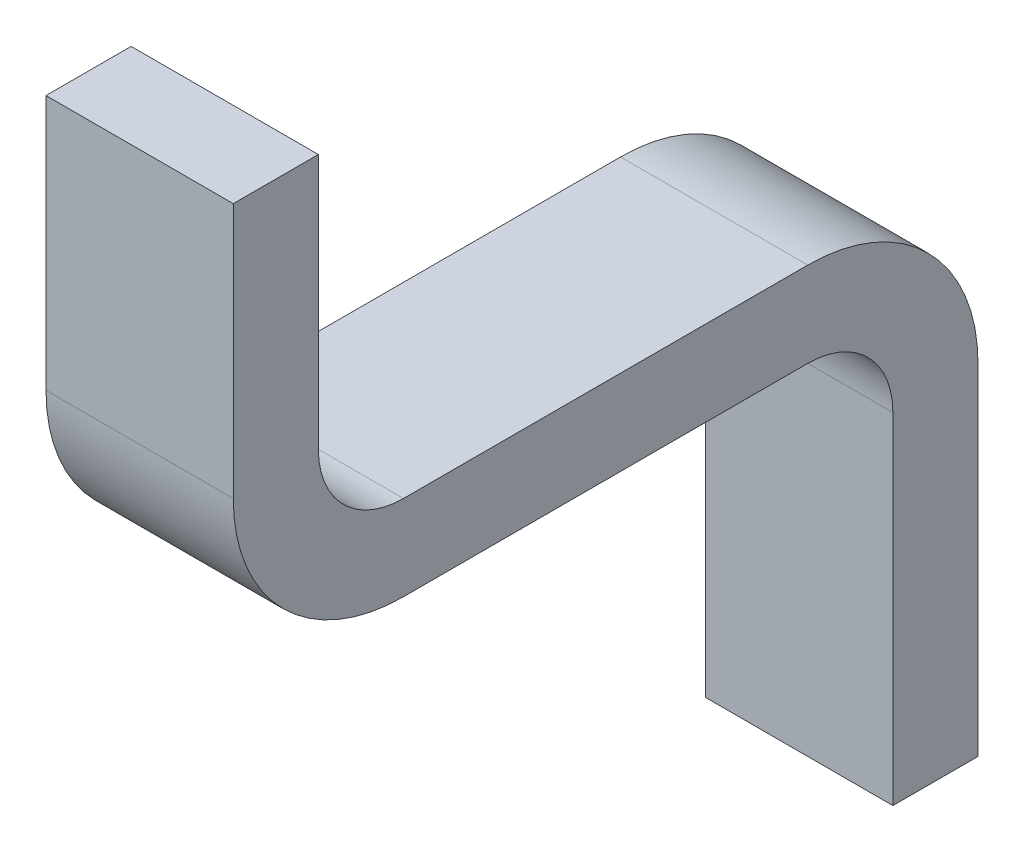
ISO-10303-21;
HEADER;
FILE_DESCRIPTION(('STEP AP214'),'2;1');
FILE_NAME('part.step','',(''),(''),'','','');
FILE_SCHEMA(('AUTOMOTIVE_DESIGN { 1 0 10303 214 1 1 1 1 }'));
ENDSEC;
DATA;
#1=APPLICATION_CONTEXT('core data for automotive mechanical design processes');
#2=APPLICATION_PROTOCOL_DEFINITION('international standard','automotive_design',2000,#1);
#3=PRODUCT_CONTEXT('',#1,'mechanical');
#4=PRODUCT('Part','Part','',(#3));
#5=PRODUCT_RELATED_PRODUCT_CATEGORY('part','',(#4));
#6=PRODUCT_DEFINITION_FORMATION('','',#4);
#7=PRODUCT_DEFINITION_CONTEXT('part definition',#1,'design');
#8=PRODUCT_DEFINITION('design','',#6,#7);
#9=PRODUCT_DEFINITION_SHAPE('','',#8);
#10=(LENGTH_UNIT() NAMED_UNIT(*) SI_UNIT(.MILLI.,.METRE.));
#11=(NAMED_UNIT(*) PLANE_ANGLE_UNIT() SI_UNIT($,.RADIAN.));
#12=(NAMED_UNIT(*) SI_UNIT($,.STERADIAN.) SOLID_ANGLE_UNIT());
#13=UNCERTAINTY_MEASURE_WITH_UNIT(LENGTH_MEASURE(1.E-05),#10,'distance_accuracy_value','');
#14=(GEOMETRIC_REPRESENTATION_CONTEXT(3) GLOBAL_UNCERTAINTY_ASSIGNED_CONTEXT((#13)) GLOBAL_UNIT_ASSIGNED_CONTEXT((#10,
#11,#12)) REPRESENTATION_CONTEXT('',''));
#15=CARTESIAN_POINT('',(0.,0.,0.));
#16=DIRECTION('',(0.,0.,1.));
#17=DIRECTION('',(1.,0.,0.));
#18=AXIS2_PLACEMENT_3D('',#15,#16,#17);
#19=CARTESIAN_POINT('',(-0.86,-4.,0.675));
#20=DIRECTION('',(1.,0.,0.));
#21=DIRECTION('',(0.,1.,0.));
#22=AXIS2_PLACEMENT_3D('',#19,#20,#21);
#23=PLANE('',#22);
#24=CARTESIAN_POINT('',(-0.860000000000001,-3.8,0.675));
#25=DIRECTION('',(-1.,0.,0.));
#26=DIRECTION('',(0.,-1.,0.));
#27=AXIS2_PLACEMENT_3D('',#24,#25,#26);
#28=CIRCLE('',#27,0.2);
#29=CARTESIAN_POINT('',(-0.860000000000001,-3.8,0.875));
#30=VERTEX_POINT('',#29);
#31=CARTESIAN_POINT('',(-0.86,-4.,0.675));
#32=VERTEX_POINT('',#31);
#33=EDGE_CURVE('E150',#30,#32,#28,.F.);
#34=ORIENTED_EDGE('',*,*,#33,.F.);
#35=DIRECTION('',(0.,1.,0.));
#36=VECTOR('',#35,1.);
#37=CARTESIAN_POINT('',(-0.86,-3.50000000000001,0.875));
#38=LINE('',#37,#36);
#39=CARTESIAN_POINT('',(-0.86,-3.50000000000001,0.875));
#40=VERTEX_POINT('',#39);
#41=EDGE_CURVE('E147',#30,#40,#38,.T.);
#42=ORIENTED_EDGE('',*,*,#41,.T.);
#43=DIRECTION('',(0.,0.,1.));
#44=VECTOR('',#43,1.);
#45=CARTESIAN_POINT('',(-0.86,-3.50000000000001,0.775));
#46=LINE('',#45,#44);
#47=CARTESIAN_POINT('',(-0.86,-3.50000000000001,0.775));
#48=VERTEX_POINT('',#47);
#49=EDGE_CURVE('E141',#48,#40,#46,.T.);
#50=ORIENTED_EDGE('',*,*,#49,.F.);
#51=DIRECTION('',(0.,1.,0.));
#52=VECTOR('',#51,1.);
#53=CARTESIAN_POINT('',(-0.86,-3.50000000000001,0.775));
#54=LINE('',#53,#52);
#55=CARTESIAN_POINT('',(-0.860000000000001,-3.8,0.775));
#56=VERTEX_POINT('',#55);
#57=EDGE_CURVE('E115',#48,#56,#54,.F.);
#58=ORIENTED_EDGE('',*,*,#57,.T.);
#59=CARTESIAN_POINT('',(-0.860000000000001,-3.8,0.675));
#60=DIRECTION('',(-1.,0.,0.));
#61=DIRECTION('',(0.,-1.,0.));
#62=AXIS2_PLACEMENT_3D('',#59,#60,#61);
#63=CIRCLE('',#62,0.1);
#64=CARTESIAN_POINT('',(-0.860000000000001,-3.90000000000001,0.675));
#65=VERTEX_POINT('',#64);
#66=EDGE_CURVE('E215',#56,#65,#63,.F.);
#67=ORIENTED_EDGE('',*,*,#66,.T.);
#68=DIRECTION('',(0.,0.,1.));
#69=VECTOR('',#68,1.);
#70=CARTESIAN_POINT('',(-0.860000000000001,-3.90000000000001,0.675));
#71=LINE('',#70,#69);
#72=CARTESIAN_POINT('',(-0.860000000000001,-3.90000000000001,0.2));
#73=VERTEX_POINT('',#72);
#74=EDGE_CURVE('E181',#65,#73,#71,.F.);
#75=ORIENTED_EDGE('',*,*,#74,.T.);
#76=CARTESIAN_POINT('',(-0.86,-4.1,0.2));
#77=DIRECTION('',(1.,0.,0.));
#78=DIRECTION('',(0.,1.,0.));
#79=AXIS2_PLACEMENT_3D('',#76,#77,#78);
#80=CIRCLE('',#79,0.2);
#81=CARTESIAN_POINT('',(-0.86,-4.1,0.));
#82=VERTEX_POINT('',#81);
#83=EDGE_CURVE('E20',#82,#73,#80,.T.);
#84=ORIENTED_EDGE('',*,*,#83,.F.);
#85=DIRECTION('',(0.,1.,0.));
#86=VECTOR('',#85,1.);
#87=CARTESIAN_POINT('',(-0.86,-4.1,0.));
#88=LINE('',#87,#86);
#89=CARTESIAN_POINT('',(-0.86,-4.5,0.));
#90=VERTEX_POINT('',#89);
#91=EDGE_CURVE('E91',#82,#90,#88,.F.);
#92=ORIENTED_EDGE('',*,*,#91,.T.);
#93=DIRECTION('',(0.,0.,1.));
#94=VECTOR('',#93,1.);
#95=CARTESIAN_POINT('',(-0.86,-4.5,0.));
#96=LINE('',#95,#94);
#97=CARTESIAN_POINT('',(-0.86,-4.5,0.1));
#98=VERTEX_POINT('',#97);
#99=EDGE_CURVE('E163',#90,#98,#96,.T.);
#100=ORIENTED_EDGE('',*,*,#99,.T.);
#101=DIRECTION('',(0.,1.,0.));
#102=VECTOR('',#101,1.);
#103=CARTESIAN_POINT('',(-0.86,-4.1,0.1));
#104=LINE('',#103,#102);
#105=CARTESIAN_POINT('',(-0.86,-4.1,0.1));
#106=VERTEX_POINT('',#105);
#107=EDGE_CURVE('E159',#98,#106,#104,.T.);
#108=ORIENTED_EDGE('',*,*,#107,.T.);
#109=CARTESIAN_POINT('',(-0.86,-4.1,0.2));
#110=DIRECTION('',(1.,0.,0.));
#111=DIRECTION('',(0.,1.,0.));
#112=AXIS2_PLACEMENT_3D('',#109,#110,#111);
#113=CIRCLE('',#112,0.1);
#114=CARTESIAN_POINT('',(-0.86,-4.,0.2));
#115=VERTEX_POINT('',#114);
#116=EDGE_CURVE('E155',#106,#115,#113,.T.);
#117=ORIENTED_EDGE('',*,*,#116,.T.);
#118=DIRECTION('',(0.,0.,1.));
#119=VECTOR('',#118,1.);
#120=CARTESIAN_POINT('',(-0.86,-4.,0.675));
#121=LINE('',#120,#119);
#122=EDGE_CURVE('E154',#115,#32,#121,.T.);
#123=ORIENTED_EDGE('',*,*,#122,.T.);
#124=EDGE_LOOP('',(#34,#42,#50,#58,#67,#75,#84,#92,#100,#108,#117,#123));
#125=FACE_BOUND('',#124,.T.);
#126=ADVANCED_FACE('F17',(#125),#23,.F.);
#127=CARTESIAN_POINT('',(-0.86,-4.1,0.2));
#128=DIRECTION('',(1.,0.,0.));
#129=DIRECTION('',(0.,1.,0.));
#130=AXIS2_PLACEMENT_3D('',#127,#128,#129);
#131=CYLINDRICAL_SURFACE('',#130,0.2);
#132=CARTESIAN_POINT('',(-0.64,-4.1,0.2));
#133=DIRECTION('',(1.,0.,0.));
#134=DIRECTION('',(0.,1.,0.));
#135=AXIS2_PLACEMENT_3D('',#132,#133,#134);
#136=CIRCLE('',#135,0.2);
#137=CARTESIAN_POINT('',(-0.640000000000001,-3.90000000000001,0.2));
#138=VERTEX_POINT('',#137);
#139=CARTESIAN_POINT('',(-0.64,-4.1,0.));
#140=VERTEX_POINT('',#139);
#141=EDGE_CURVE('E183',#138,#140,#136,.F.);
#142=ORIENTED_EDGE('',*,*,#141,.T.);
#143=DIRECTION('',(1.,0.,0.));
#144=VECTOR('',#143,1.);
#145=CARTESIAN_POINT('',(-0.86,-4.1,0.));
#146=LINE('',#145,#144);
#147=EDGE_CURVE('E178',#140,#82,#146,.F.);
#148=ORIENTED_EDGE('',*,*,#147,.T.);
#149=ORIENTED_EDGE('',*,*,#83,.T.);
#150=DIRECTION('',(1.,0.,0.));
#151=VECTOR('',#150,1.);
#152=CARTESIAN_POINT('',(-0.860000000000001,-3.90000000000001,0.2));
#153=LINE('',#152,#151);
#154=EDGE_CURVE('E217',#73,#138,#153,.T.);
#155=ORIENTED_EDGE('',*,*,#154,.T.);
#156=EDGE_LOOP('',(#142,#148,#149,#155));
#157=FACE_BOUND('',#156,.T.);
#158=ADVANCED_FACE('F254',(#157),#131,.T.);
#159=CARTESIAN_POINT('',(-0.86,-4.1,0.));
#160=DIRECTION('',(0.,0.,1.));
#161=DIRECTION('',(1.,0.,0.));
#162=AXIS2_PLACEMENT_3D('',#159,#160,#161);
#163=PLANE('',#162);
#164=ORIENTED_EDGE('',*,*,#147,.F.);
#165=DIRECTION('',(0.,-1.,0.));
#166=VECTOR('',#165,1.);
#167=CARTESIAN_POINT('',(-0.640000000000001,-3.90000000000001,0.));
#168=LINE('',#167,#166);
#169=CARTESIAN_POINT('',(-0.64,-4.5,0.));
#170=VERTEX_POINT('',#169);
#171=EDGE_CURVE('E170',#140,#170,#168,.T.);
#172=ORIENTED_EDGE('',*,*,#171,.T.);
#173=DIRECTION('',(-1.,0.,0.));
#174=VECTOR('',#173,1.);
#175=CARTESIAN_POINT('',(-0.86,-4.5,0.));
#176=LINE('',#175,#174);
#177=EDGE_CURVE('E173',#170,#90,#176,.T.);
#178=ORIENTED_EDGE('',*,*,#177,.T.);
#179=ORIENTED_EDGE('',*,*,#91,.F.);
#180=EDGE_LOOP('',(#164,#172,#178,#179));
#181=FACE_BOUND('',#180,.T.);
#182=ADVANCED_FACE('F257',(#181),#163,.F.);
#183=CARTESIAN_POINT('',(-0.86,-4.5,0.));
#184=DIRECTION('',(0.,1.,0.));
#185=DIRECTION('',(-1.,0.,0.));
#186=AXIS2_PLACEMENT_3D('',#183,#184,#185);
#187=PLANE('',#186);
#188=DIRECTION('',(-1.,0.,0.));
#189=VECTOR('',#188,1.);
#190=CARTESIAN_POINT('',(-0.64,-4.5,0.1));
#191=LINE('',#190,#189);
#192=CARTESIAN_POINT('',(-0.64,-4.5,0.1));
#193=VERTEX_POINT('',#192);
#194=EDGE_CURVE('E160',#193,#98,#191,.T.);
#195=ORIENTED_EDGE('',*,*,#194,.T.);
#196=ORIENTED_EDGE('',*,*,#99,.F.);
#197=ORIENTED_EDGE('',*,*,#177,.F.);
#198=DIRECTION('',(0.,0.,1.));
#199=VECTOR('',#198,1.);
#200=CARTESIAN_POINT('',(-0.64,-4.5,0.675));
#201=LINE('',#200,#199);
#202=EDGE_CURVE('E166',#170,#193,#201,.T.);
#203=ORIENTED_EDGE('',*,*,#202,.T.);
#204=EDGE_LOOP('',(#195,#196,#197,#203));
#205=FACE_BOUND('',#204,.T.);
#206=ADVANCED_FACE('F259',(#205),#187,.F.);
#207=CARTESIAN_POINT('',(-0.64,-4.1,0.1));
#208=DIRECTION('',(0.,0.,-1.));
#209=DIRECTION('',(-1.,0.,0.));
#210=AXIS2_PLACEMENT_3D('',#207,#208,#209);
#211=PLANE('',#210);
#212=DIRECTION('',(1.,0.,0.));
#213=VECTOR('',#212,1.);
#214=CARTESIAN_POINT('',(-0.64,-4.1,0.1));
#215=LINE('',#214,#213);
#216=CARTESIAN_POINT('',(-0.64,-4.1,0.1));
#217=VERTEX_POINT('',#216);
#218=EDGE_CURVE('E156',#217,#106,#215,.F.);
#219=ORIENTED_EDGE('',*,*,#218,.T.);
#220=ORIENTED_EDGE('',*,*,#107,.F.);
#221=ORIENTED_EDGE('',*,*,#194,.F.);
#222=DIRECTION('',(0.,-1.,0.));
#223=VECTOR('',#222,1.);
#224=CARTESIAN_POINT('',(-0.640000000000001,-3.90000000000001,0.1));
#225=LINE('',#224,#223);
#226=EDGE_CURVE('E169',#193,#217,#225,.F.);
#227=ORIENTED_EDGE('',*,*,#226,.T.);
#228=EDGE_LOOP('',(#219,#220,#221,#227));
#229=FACE_BOUND('',#228,.T.);
#230=ADVANCED_FACE('F234',(#229),#211,.F.);
#231=CARTESIAN_POINT('',(-0.64,-4.1,0.2));
#232=DIRECTION('',(1.,0.,0.));
#233=DIRECTION('',(0.,1.,0.));
#234=AXIS2_PLACEMENT_3D('',#231,#232,#233);
#235=CYLINDRICAL_SURFACE('',#234,0.1);
#236=DIRECTION('',(-1.,0.,0.));
#237=VECTOR('',#236,1.);
#238=CARTESIAN_POINT('',(-0.64,-4.,0.2));
#239=LINE('',#238,#237);
#240=CARTESIAN_POINT('',(-0.64,-4.,0.2));
#241=VERTEX_POINT('',#240);
#242=EDGE_CURVE('E151',#241,#115,#239,.T.);
#243=ORIENTED_EDGE('',*,*,#242,.T.);
#244=ORIENTED_EDGE('',*,*,#116,.F.);
#245=ORIENTED_EDGE('',*,*,#218,.F.);
#246=CARTESIAN_POINT('',(-0.64,-4.1,0.2));
#247=DIRECTION('',(1.,0.,0.));
#248=DIRECTION('',(0.,1.,0.));
#249=AXIS2_PLACEMENT_3D('',#246,#247,#248);
#250=CIRCLE('',#249,0.1);
#251=EDGE_CURVE('E210',#217,#241,#250,.T.);
#252=ORIENTED_EDGE('',*,*,#251,.T.);
#253=EDGE_LOOP('',(#243,#244,#245,#252));
#254=FACE_BOUND('',#253,.T.);
#255=ADVANCED_FACE('F227',(#254),#235,.F.);
#256=CARTESIAN_POINT('',(-0.64,-4.,0.675));
#257=DIRECTION('',(0.,1.,0.));
#258=DIRECTION('',(-1.,0.,0.));
#259=AXIS2_PLACEMENT_3D('',#256,#257,#258);
#260=PLANE('',#259);
#261=DIRECTION('',(-1.,0.,0.));
#262=VECTOR('',#261,1.);
#263=CARTESIAN_POINT('',(-0.64,-4.,0.675));
#264=LINE('',#263,#262);
#265=CARTESIAN_POINT('',(-0.64,-4.,0.675));
#266=VERTEX_POINT('',#265);
#267=EDGE_CURVE('E148',#32,#266,#264,.F.);
#268=ORIENTED_EDGE('',*,*,#267,.F.);
#269=ORIENTED_EDGE('',*,*,#122,.F.);
#270=ORIENTED_EDGE('',*,*,#242,.F.);
#271=DIRECTION('',(0.,0.,1.));
#272=VECTOR('',#271,1.);
#273=CARTESIAN_POINT('',(-0.64,-4.,0.675));
#274=LINE('',#273,#272);
#275=EDGE_CURVE('E209',#241,#266,#274,.T.);
#276=ORIENTED_EDGE('',*,*,#275,.T.);
#277=EDGE_LOOP('',(#268,#269,#270,#276));
#278=FACE_BOUND('',#277,.T.);
#279=ADVANCED_FACE('F224',(#278),#260,.F.);
#280=CARTESIAN_POINT('',(-0.640000000000001,-3.8,0.675));
#281=DIRECTION('',(-1.,0.,0.));
#282=DIRECTION('',(0.,-1.,0.));
#283=AXIS2_PLACEMENT_3D('',#280,#281,#282);
#284=CYLINDRICAL_SURFACE('',#283,0.2);
#285=ORIENTED_EDGE('',*,*,#33,.T.);
#286=ORIENTED_EDGE('',*,*,#267,.T.);
#287=CARTESIAN_POINT('',(-0.640000000000001,-3.8,0.675));
#288=DIRECTION('',(-1.,0.,0.));
#289=DIRECTION('',(0.,-1.,0.));
#290=AXIS2_PLACEMENT_3D('',#287,#288,#289);
#291=CIRCLE('',#290,0.2);
#292=CARTESIAN_POINT('',(-0.640000000000001,-3.8,0.875));
#293=VERTEX_POINT('',#292);
#294=EDGE_CURVE('E133',#266,#293,#291,.T.);
#295=ORIENTED_EDGE('',*,*,#294,.T.);
#296=DIRECTION('',(-1.,0.,0.));
#297=VECTOR('',#296,1.);
#298=CARTESIAN_POINT('',(-0.640000000000001,-3.8,0.875));
#299=LINE('',#298,#297);
#300=EDGE_CURVE('E144',#293,#30,#299,.T.);
#301=ORIENTED_EDGE('',*,*,#300,.T.);
#302=EDGE_LOOP('',(#285,#286,#295,#301));
#303=FACE_BOUND('',#302,.T.);
#304=ADVANCED_FACE('F285',(#303),#284,.T.);
#305=CARTESIAN_POINT('',(-0.64,-3.50000000000001,0.875));
#306=DIRECTION('',(0.,0.,-1.));
#307=DIRECTION('',(-1.,0.,0.));
#308=AXIS2_PLACEMENT_3D('',#305,#306,#307);
#309=PLANE('',#308);
#310=DIRECTION('',(-1.,0.,0.));
#311=VECTOR('',#310,1.);
#312=CARTESIAN_POINT('',(-0.86,-3.50000000000001,0.875));
#313=LINE('',#312,#311);
#314=CARTESIAN_POINT('',(-0.64,-3.50000000000001,0.875));
#315=VERTEX_POINT('',#314);
#316=EDGE_CURVE('E118',#40,#315,#313,.F.);
#317=ORIENTED_EDGE('',*,*,#316,.F.);
#318=ORIENTED_EDGE('',*,*,#41,.F.);
#319=ORIENTED_EDGE('',*,*,#300,.F.);
#320=DIRECTION('',(0.,-1.,0.));
#321=VECTOR('',#320,1.);
#322=CARTESIAN_POINT('',(-0.640000000000001,-3.90000000000001,0.875));
#323=LINE('',#322,#321);
#324=EDGE_CURVE('E131',#293,#315,#323,.F.);
#325=ORIENTED_EDGE('',*,*,#324,.T.);
#326=EDGE_LOOP('',(#317,#318,#319,#325));
#327=FACE_BOUND('',#326,.T.);
#328=ADVANCED_FACE('F282',(#327),#309,.F.);
#329=CARTESIAN_POINT('',(-0.86,-3.50000000000001,0.775));
#330=DIRECTION('',(0.,1.,0.));
#331=DIRECTION('',(-1.,0.,0.));
#332=AXIS2_PLACEMENT_3D('',#329,#330,#331);
#333=PLANE('',#332);
#334=ORIENTED_EDGE('',*,*,#49,.T.);
#335=ORIENTED_EDGE('',*,*,#316,.T.);
#336=DIRECTION('',(0.,0.,1.));
#337=VECTOR('',#336,1.);
#338=CARTESIAN_POINT('',(-0.64,-3.50000000000001,0.675));
#339=LINE('',#338,#337);
#340=CARTESIAN_POINT('',(-0.64,-3.50000000000001,0.775));
#341=VERTEX_POINT('',#340);
#342=EDGE_CURVE('E125',#315,#341,#339,.F.);
#343=ORIENTED_EDGE('',*,*,#342,.T.);
#344=DIRECTION('',(1.,0.,0.));
#345=VECTOR('',#344,1.);
#346=CARTESIAN_POINT('',(-0.86,-3.50000000000001,0.775));
#347=LINE('',#346,#345);
#348=EDGE_CURVE('E110',#341,#48,#347,.F.);
#349=ORIENTED_EDGE('',*,*,#348,.T.);
#350=EDGE_LOOP('',(#334,#335,#343,#349));
#351=FACE_BOUND('',#350,.T.);
#352=ADVANCED_FACE('F129',(#351),#333,.T.);
#353=CARTESIAN_POINT('',(-0.86,-3.50000000000001,0.775));
#354=DIRECTION('',(0.,0.,1.));
#355=DIRECTION('',(1.,0.,0.));
#356=AXIS2_PLACEMENT_3D('',#353,#354,#355);
#357=PLANE('',#356);
#358=ORIENTED_EDGE('',*,*,#348,.F.);
#359=DIRECTION('',(0.,-1.,0.));
#360=VECTOR('',#359,1.);
#361=CARTESIAN_POINT('',(-0.640000000000001,-3.90000000000001,0.775));
#362=LINE('',#361,#360);
#363=CARTESIAN_POINT('',(-0.640000000000001,-3.8,0.775));
#364=VERTEX_POINT('',#363);
#365=EDGE_CURVE('E114',#341,#364,#362,.T.);
#366=ORIENTED_EDGE('',*,*,#365,.T.);
#367=DIRECTION('',(-1.,0.,0.));
#368=VECTOR('',#367,1.);
#369=CARTESIAN_POINT('',(-0.860000000000001,-3.8,0.775));
#370=LINE('',#369,#368);
#371=EDGE_CURVE('E185',#364,#56,#370,.T.);
#372=ORIENTED_EDGE('',*,*,#371,.T.);
#373=ORIENTED_EDGE('',*,*,#57,.F.);
#374=EDGE_LOOP('',(#358,#366,#372,#373));
#375=FACE_BOUND('',#374,.T.);
#376=ADVANCED_FACE('F112',(#375),#357,.F.);
#377=CARTESIAN_POINT('',(-0.860000000000001,-3.8,0.675));
#378=DIRECTION('',(-1.,0.,0.));
#379=DIRECTION('',(0.,-1.,0.));
#380=AXIS2_PLACEMENT_3D('',#377,#378,#379);
#381=CYLINDRICAL_SURFACE('',#380,0.1);
#382=ORIENTED_EDGE('',*,*,#371,.F.);
#383=CARTESIAN_POINT('',(-0.640000000000001,-3.8,0.675));
#384=DIRECTION('',(-1.,0.,0.));
#385=DIRECTION('',(0.,-1.,0.));
#386=AXIS2_PLACEMENT_3D('',#383,#384,#385);
#387=CIRCLE('',#386,0.1);
#388=CARTESIAN_POINT('',(-0.640000000000001,-3.90000000000001,0.675));
#389=VERTEX_POINT('',#388);
#390=EDGE_CURVE('E26',#364,#389,#387,.F.);
#391=ORIENTED_EDGE('',*,*,#390,.T.);
#392=DIRECTION('',(1.,0.,0.));
#393=VECTOR('',#392,1.);
#394=CARTESIAN_POINT('',(-0.860000000000001,-3.90000000000001,0.675));
#395=LINE('',#394,#393);
#396=EDGE_CURVE('E34',#389,#65,#395,.F.);
#397=ORIENTED_EDGE('',*,*,#396,.T.);
#398=ORIENTED_EDGE('',*,*,#66,.F.);
#399=EDGE_LOOP('',(#382,#391,#397,#398));
#400=FACE_BOUND('',#399,.T.);
#401=ADVANCED_FACE('F250',(#400),#381,.F.);
#402=CARTESIAN_POINT('',(-0.860000000000001,-3.90000000000001,0.675));
#403=DIRECTION('',(0.,-1.,0.));
#404=DIRECTION('',(1.,0.,0.));
#405=AXIS2_PLACEMENT_3D('',#402,#403,#404);
#406=PLANE('',#405);
#407=ORIENTED_EDGE('',*,*,#396,.F.);
#408=DIRECTION('',(0.,0.,1.));
#409=VECTOR('',#408,1.);
#410=CARTESIAN_POINT('',(-0.640000000000001,-3.90000000000001,0.675));
#411=LINE('',#410,#409);
#412=EDGE_CURVE('E11',#389,#138,#411,.F.);
#413=ORIENTED_EDGE('',*,*,#412,.T.);
#414=ORIENTED_EDGE('',*,*,#154,.F.);
#415=ORIENTED_EDGE('',*,*,#74,.F.);
#416=EDGE_LOOP('',(#407,#413,#414,#415));
#417=FACE_BOUND('',#416,.T.);
#418=ADVANCED_FACE('F252',(#417),#406,.F.);
#419=CARTESIAN_POINT('',(-0.640000000000001,-3.90000000000001,0.675));
#420=DIRECTION('',(-1.,0.,0.));
#421=DIRECTION('',(0.,-1.,0.));
#422=AXIS2_PLACEMENT_3D('',#419,#420,#421);
#423=PLANE('',#422);
#424=ORIENTED_EDGE('',*,*,#390,.F.);
#425=ORIENTED_EDGE('',*,*,#365,.F.);
#426=ORIENTED_EDGE('',*,*,#342,.F.);
#427=ORIENTED_EDGE('',*,*,#324,.F.);
#428=ORIENTED_EDGE('',*,*,#294,.F.);
#429=ORIENTED_EDGE('',*,*,#275,.F.);
#430=ORIENTED_EDGE('',*,*,#251,.F.);
#431=ORIENTED_EDGE('',*,*,#226,.F.);
#432=ORIENTED_EDGE('',*,*,#202,.F.);
#433=ORIENTED_EDGE('',*,*,#171,.F.);
#434=ORIENTED_EDGE('',*,*,#141,.F.);
#435=ORIENTED_EDGE('',*,*,#412,.F.);
#436=EDGE_LOOP('',(#424,#425,#426,#427,#428,#429,#430,#431,#432,#433,#434,#435));
#437=FACE_BOUND('',#436,.T.);
#438=ADVANCED_FACE('F123',(#437),#423,.F.);
#439=CLOSED_SHELL('',(#126,#158,#182,#206,#230,#255,#279,#304,#328,#352,#376,#401,#418,#438));
#440=MANIFOLD_SOLID_BREP('B1',#439);
#441=ADVANCED_BREP_SHAPE_REPRESENTATION('',(#18,#440),#14);
#442=SHAPE_DEFINITION_REPRESENTATION(#9,#441);
ENDSEC;
END-ISO-10303-21;
